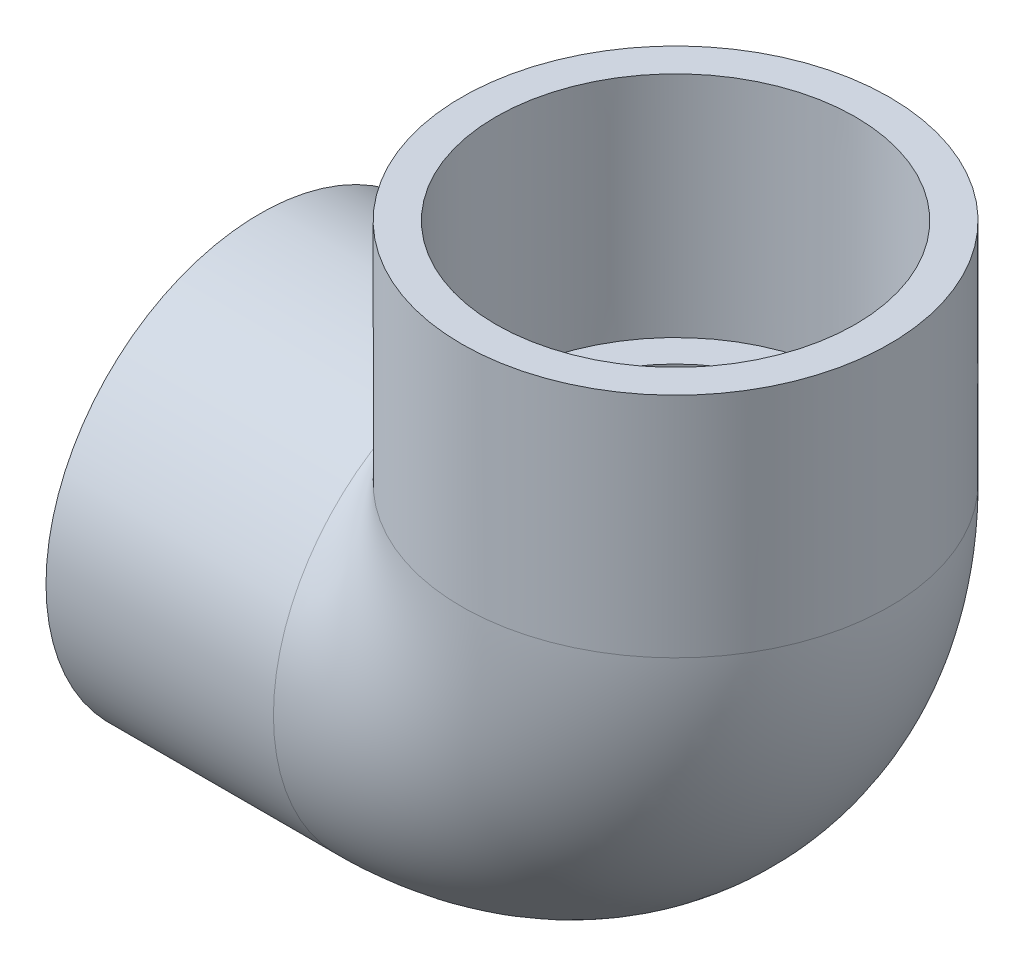
ISO-10303-21;
HEADER;
FILE_DESCRIPTION(('STEP AP214'),'2;1');
FILE_NAME('part.step','',(''),(''),'','','');
FILE_SCHEMA(('AUTOMOTIVE_DESIGN { 1 0 10303 214 1 1 1 1 }'));
ENDSEC;
DATA;
#1=APPLICATION_CONTEXT('core data for automotive mechanical design processes');
#2=APPLICATION_PROTOCOL_DEFINITION('international standard','automotive_design',2000,#1);
#3=PRODUCT_CONTEXT('',#1,'mechanical');
#4=PRODUCT('Part','Part','',(#3));
#5=PRODUCT_RELATED_PRODUCT_CATEGORY('part','',(#4));
#6=PRODUCT_DEFINITION_FORMATION('','',#4);
#7=PRODUCT_DEFINITION_CONTEXT('part definition',#1,'design');
#8=PRODUCT_DEFINITION('design','',#6,#7);
#9=PRODUCT_DEFINITION_SHAPE('','',#8);
#10=(LENGTH_UNIT() NAMED_UNIT(*) SI_UNIT(.MILLI.,.METRE.));
#11=(NAMED_UNIT(*) PLANE_ANGLE_UNIT() SI_UNIT($,.RADIAN.));
#12=(NAMED_UNIT(*) SI_UNIT($,.STERADIAN.) SOLID_ANGLE_UNIT());
#13=UNCERTAINTY_MEASURE_WITH_UNIT(LENGTH_MEASURE(1.E-05),#10,'distance_accuracy_value','');
#14=(GEOMETRIC_REPRESENTATION_CONTEXT(3) GLOBAL_UNCERTAINTY_ASSIGNED_CONTEXT((#13)) GLOBAL_UNIT_ASSIGNED_CONTEXT((#10,
#11,#12)) REPRESENTATION_CONTEXT('',''));
#15=CARTESIAN_POINT('',(0.,0.,0.));
#16=DIRECTION('',(0.,0.,1.));
#17=DIRECTION('',(1.,0.,0.));
#18=AXIS2_PLACEMENT_3D('',#15,#16,#17);
#19=CARTESIAN_POINT('',(-70.1039999999999,-36.068,0.));
#20=DIRECTION('',(-1.,0.,0.));
#21=DIRECTION('',(0.,0.,1.));
#22=AXIS2_PLACEMENT_3D('',#19,#20,#21);
#23=PLANE('',#22);
#24=CARTESIAN_POINT('',(-70.1039999999999,0.,0.));
#25=DIRECTION('',(-1.,0.,0.));
#26=DIRECTION('',(0.,0.,1.));
#27=AXIS2_PLACEMENT_3D('',#24,#25,#26);
#28=CIRCLE('',#27,36.068);
#29=CARTESIAN_POINT('',(-70.1039999999999,0.,36.068));
#30=VERTEX_POINT('',#29);
#31=EDGE_CURVE('E54',#30,#30,#28,.T.);
#32=ORIENTED_EDGE('',*,*,#31,.T.);
#33=EDGE_LOOP('',(#32));
#34=FACE_BOUND('',#33,.T.);
#35=CARTESIAN_POINT('',(-70.1039999999999,0.,0.));
#36=DIRECTION('',(-1.,0.,0.));
#37=DIRECTION('',(0.,0.,1.));
#38=AXIS2_PLACEMENT_3D('',#35,#36,#37);
#39=CIRCLE('',#38,30.3149);
#40=CARTESIAN_POINT('',(-70.1039999999999,0.,30.3149));
#41=VERTEX_POINT('',#40);
#42=EDGE_CURVE('E41',#41,#41,#39,.T.);
#43=ORIENTED_EDGE('',*,*,#42,.F.);
#44=EDGE_LOOP('',(#43));
#45=FACE_BOUND('',#44,.T.);
#46=ADVANCED_FACE('F34',(#34,#45),#23,.T.);
#47=CARTESIAN_POINT('',(-31.7499999999999,0.,0.));
#48=DIRECTION('',(-1.,0.,0.));
#49=DIRECTION('',(0.,0.,1.));
#50=AXIS2_PLACEMENT_3D('',#47,#48,#49);
#51=CONICAL_SURFACE('',#50,30.0863,0.0059601943231777);
#52=ORIENTED_EDGE('',*,*,#42,.T.);
#53=EDGE_LOOP('',(#52));
#54=FACE_BOUND('',#53,.T.);
#55=CARTESIAN_POINT('',(-31.7499999999999,0.,0.));
#56=DIRECTION('',(-1.,0.,0.));
#57=DIRECTION('',(0.,0.,1.));
#58=AXIS2_PLACEMENT_3D('',#55,#56,#57);
#59=CIRCLE('',#58,30.0863);
#60=CARTESIAN_POINT('',(-31.7499999999999,0.,30.0863));
#61=VERTEX_POINT('',#60);
#62=EDGE_CURVE('E65',#61,#61,#59,.T.);
#63=ORIENTED_EDGE('',*,*,#62,.F.);
#64=EDGE_LOOP('',(#63));
#65=FACE_BOUND('',#64,.T.);
#66=ADVANCED_FACE('F74',(#54,#65),#51,.F.);
#67=CARTESIAN_POINT('',(-70.1039999999999,0.,0.));
#68=DIRECTION('',(-1.,0.,0.));
#69=DIRECTION('',(0.,0.,1.));
#70=AXIS2_PLACEMENT_3D('',#67,#68,#69);
#71=CYLINDRICAL_SURFACE('',#70,36.068);
#72=CARTESIAN_POINT('',(0.,0.,0.));
#73=DIRECTION('',(-0.707106781186548,-0.707106781186547,0.));
#74=DIRECTION('',(-0.707106781186548,0.707106781186547,0.));
#75=AXIS2_PLACEMENT_3D('',#72,#73,#74);
#76=ELLIPSE('',#75,51.0078547676728,36.068);
#77=CARTESIAN_POINT('',(-31.7499999999999,31.7500000000002,-17.1125136669047));
#78=VERTEX_POINT('',#77);
#79=CARTESIAN_POINT('',(-31.7499999999999,31.7500000000002,17.1125136669047));
#80=VERTEX_POINT('',#79);
#81=EDGE_CURVE('E53',#78,#80,#76,.F.);
#82=ORIENTED_EDGE('',*,*,#81,.F.);
#83=CARTESIAN_POINT('',(-31.7499999999999,0.,0.));
#84=DIRECTION('',(-1.,0.,0.));
#85=DIRECTION('',(0.,0.,1.));
#86=AXIS2_PLACEMENT_3D('',#83,#84,#85);
#87=CIRCLE('',#86,36.068);
#88=EDGE_CURVE('E60',#78,#80,#87,.T.);
#89=ORIENTED_EDGE('',*,*,#88,.T.);
#90=EDGE_LOOP('',(#82,#89));
#91=FACE_BOUND('',#90,.T.);
#92=ORIENTED_EDGE('',*,*,#31,.F.);
#93=EDGE_LOOP('',(#92));
#94=FACE_BOUND('',#93,.T.);
#95=ADVANCED_FACE('F58',(#91,#94),#71,.T.);
#96=CARTESIAN_POINT('',(-31.7499999999999,31.7500000000002,0.));
#97=DIRECTION('',(0.,0.,-1.));
#98=DIRECTION('',(-1.,0.,0.));
#99=AXIS2_PLACEMENT_3D('',#96,#97,#98);
#100=TOROIDAL_SURFACE('',#99,31.75,24.6253);
#101=CARTESIAN_POINT('',(0.,31.7500000000002,0.));
#102=DIRECTION('',(0.,1.,0.));
#103=DIRECTION('',(0.,0.,-1.));
#104=AXIS2_PLACEMENT_3D('',#101,#102,#103);
#105=CIRCLE('',#104,24.6253);
#106=CARTESIAN_POINT('',(24.6253000000001,31.7500000000002,0.));
#107=VERTEX_POINT('',#106);
#108=EDGE_CURVE('E55',#107,#107,#105,.T.);
#109=CARTESIAN_POINT('',(-31.7499999999999,0.,0.));
#110=DIRECTION('',(1.,0.,0.));
#111=DIRECTION('',(0.,0.,-1.));
#112=AXIS2_PLACEMENT_3D('',#109,#110,#111);
#113=CIRCLE('',#112,24.6253);
#114=CARTESIAN_POINT('',(-31.7499999999999,-24.6252999999998,0.));
#115=VERTEX_POINT('',#114);
#116=EDGE_CURVE('E61',#115,#115,#113,.T.);
#117=CARTESIAN_POINT('',(-31.7499999999999,31.7500000000002,0.));
#118=DIRECTION('',(0.,0.,-1.));
#119=DIRECTION('',(-1.,0.,0.));
#120=AXIS2_PLACEMENT_3D('',#117,#118,#119);
#121=CIRCLE('',#120,56.3753);
#122=EDGE_CURVE('',#107,#115,#121,.T.);
#123=ORIENTED_EDGE('',*,*,#108,.T.);
#124=ORIENTED_EDGE('',*,*,#116,.F.);
#125=ORIENTED_EDGE('',*,*,#122,.T.);
#126=ORIENTED_EDGE('',*,*,#122,.F.);
#127=EDGE_LOOP('',(#123,#125,#124,#126));
#128=FACE_BOUND('',#127,.T.);
#129=ADVANCED_FACE('F84',(#128),#100,.F.);
#130=CARTESIAN_POINT('',(-63.5,31.7500000000002,0.));
#131=DIRECTION('',(0.,-1.,0.));
#132=DIRECTION('',(-1.,0.,0.));
#133=AXIS2_PLACEMENT_3D('',#130,#131,#132);
#134=CIRCLE('',#133,36.068);
#135=TRIMMED_CURVE('',#134,(PARAMETER_VALUE(-2.6472519182026)),
(PARAMETER_VALUE(2.6472519182026)),.T.,.PARAMETER.);
#136=CARTESIAN_POINT('',(-31.7499999999999,31.7500000000002,0.));
#137=DIRECTION('',(0.,0.,-1.));
#138=AXIS1_PLACEMENT('',#136,#137);
#139=SURFACE_OF_REVOLUTION('',#135,#138);
#140=CARTESIAN_POINT('',(0.,31.7500000000002,0.));
#141=DIRECTION('',(0.,1.,0.));
#142=DIRECTION('',(0.,0.,-1.));
#143=AXIS2_PLACEMENT_3D('',#140,#141,#142);
#144=CIRCLE('',#143,36.068);
#145=EDGE_CURVE('E47',#80,#78,#144,.T.);
#146=ORIENTED_EDGE('',*,*,#145,.F.);
#147=ORIENTED_EDGE('',*,*,#88,.F.);
#148=EDGE_LOOP('',(#146,#147));
#149=FACE_BOUND('',#148,.T.);
#150=ADVANCED_FACE('F64',(#149),#139,.T.);
#151=CARTESIAN_POINT('',(0.,31.7500000000002,0.));
#152=DIRECTION('',(0.,1.,0.));
#153=DIRECTION('',(0.,0.,-1.));
#154=AXIS2_PLACEMENT_3D('',#151,#152,#153);
#155=PLANE('',#154);
#156=CARTESIAN_POINT('',(0.,31.7500000000002,0.));
#157=DIRECTION('',(0.,1.,0.));
#158=DIRECTION('',(-1.,0.,0.));
#159=AXIS2_PLACEMENT_3D('',#156,#157,#158);
#160=CIRCLE('',#159,30.0863);
#161=CARTESIAN_POINT('',(-30.0863,31.7500000000002,0.));
#162=VERTEX_POINT('',#161);
#163=EDGE_CURVE('E11',#162,#162,#160,.F.);
#164=ORIENTED_EDGE('',*,*,#163,.F.);
#165=EDGE_LOOP('',(#164));
#166=FACE_BOUND('',#165,.T.);
#167=ORIENTED_EDGE('',*,*,#108,.F.);
#168=EDGE_LOOP('',(#167));
#169=FACE_BOUND('',#168,.T.);
#170=ADVANCED_FACE('F93',(#166,#169),#155,.T.);
#171=CARTESIAN_POINT('',(-31.7499999999999,0.,0.));
#172=DIRECTION('',(1.,0.,0.));
#173=DIRECTION('',(0.,0.,-1.));
#174=AXIS2_PLACEMENT_3D('',#171,#172,#173);
#175=PLANE('',#174);
#176=ORIENTED_EDGE('',*,*,#62,.T.);
#177=EDGE_LOOP('',(#176));
#178=FACE_BOUND('',#177,.T.);
#179=ORIENTED_EDGE('',*,*,#116,.T.);
#180=EDGE_LOOP('',(#179));
#181=FACE_BOUND('',#180,.T.);
#182=ADVANCED_FACE('F97',(#178,#181),#175,.F.);
#183=CARTESIAN_POINT('',(36.068,70.1040000000002,0.));
#184=DIRECTION('',(0.,1.,0.));
#185=DIRECTION('',(0.,0.,1.));
#186=AXIS2_PLACEMENT_3D('',#183,#184,#185);
#187=PLANE('',#186);
#188=CARTESIAN_POINT('',(0.,70.1040000000002,0.));
#189=DIRECTION('',(0.,-1.,0.));
#190=DIRECTION('',(0.,0.,-1.));
#191=AXIS2_PLACEMENT_3D('',#188,#189,#190);
#192=CIRCLE('',#191,30.3149);
#193=CARTESIAN_POINT('',(0.,70.1040000000002,-30.3149));
#194=VERTEX_POINT('',#193);
#195=EDGE_CURVE('E118',#194,#194,#192,.T.);
#196=ORIENTED_EDGE('',*,*,#195,.T.);
#197=EDGE_LOOP('',(#196));
#198=FACE_BOUND('',#197,.T.);
#199=CARTESIAN_POINT('',(0.,70.1040000000002,0.));
#200=DIRECTION('',(0.,-1.,0.));
#201=DIRECTION('',(0.,0.,-1.));
#202=AXIS2_PLACEMENT_3D('',#199,#200,#201);
#203=CIRCLE('',#202,36.068);
#204=CARTESIAN_POINT('',(0.,70.1040000000002,-36.068));
#205=VERTEX_POINT('',#204);
#206=EDGE_CURVE('E62',#205,#205,#203,.T.);
#207=ORIENTED_EDGE('',*,*,#206,.F.);
#208=EDGE_LOOP('',(#207));
#209=FACE_BOUND('',#208,.T.);
#210=ADVANCED_FACE('F101',(#198,#209),#187,.T.);
#211=CARTESIAN_POINT('',(0.,0.,0.));
#212=DIRECTION('',(0.,-1.,0.));
#213=DIRECTION('',(0.,0.,-1.));
#214=AXIS2_PLACEMENT_3D('',#211,#212,#213);
#215=CYLINDRICAL_SURFACE('',#214,36.068);
#216=ORIENTED_EDGE('',*,*,#206,.T.);
#217=EDGE_LOOP('',(#216));
#218=FACE_BOUND('',#217,.T.);
#219=ORIENTED_EDGE('',*,*,#145,.T.);
#220=ORIENTED_EDGE('',*,*,#81,.T.);
#221=EDGE_LOOP('',(#219,#220));
#222=FACE_BOUND('',#221,.T.);
#223=ADVANCED_FACE('F52',(#218,#222),#215,.T.);
#224=CARTESIAN_POINT('',(0.,70.1040000000002,0.));
#225=DIRECTION('',(0.,1.,0.));
#226=DIRECTION('',(0.,0.,1.));
#227=AXIS2_PLACEMENT_3D('',#224,#225,#226);
#228=CONICAL_SURFACE('',#227,30.3149,0.0059601943231777);
#229=ORIENTED_EDGE('',*,*,#163,.T.);
#230=EDGE_LOOP('',(#229));
#231=FACE_BOUND('',#230,.T.);
#232=ORIENTED_EDGE('',*,*,#195,.F.);
#233=EDGE_LOOP('',(#232));
#234=FACE_BOUND('',#233,.T.);
#235=ADVANCED_FACE('F108',(#231,#234),#228,.F.);
#236=CLOSED_SHELL('',(#46,#66,#95,#129,#150,#170,#182,#210,#223,#235));
#237=MANIFOLD_SOLID_BREP('B2',#236);
#238=ADVANCED_BREP_SHAPE_REPRESENTATION('',(#18,#237),#14);
#239=SHAPE_DEFINITION_REPRESENTATION(#9,#238);
ENDSEC;
END-ISO-10303-21;
